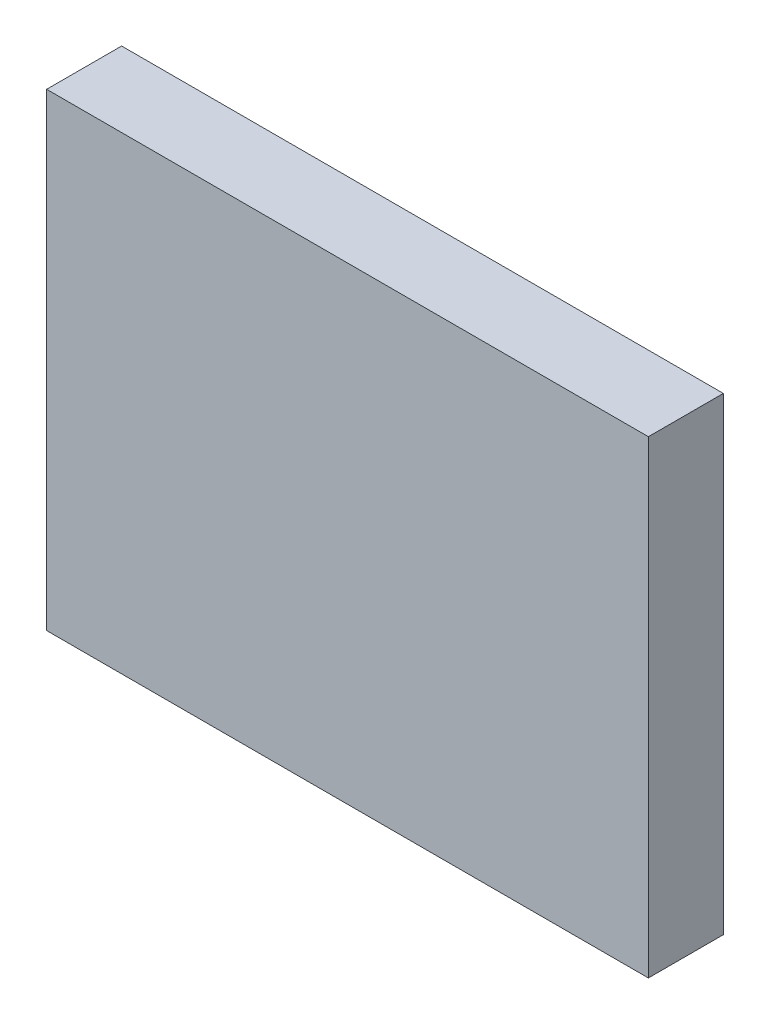
ISO-10303-21;
HEADER;
FILE_DESCRIPTION(('STEP AP214'),'2;1');
FILE_NAME('part.step','',(''),(''),'','','');
FILE_SCHEMA(('AUTOMOTIVE_DESIGN { 1 0 10303 214 1 1 1 1 }'));
ENDSEC;
DATA;
#1=APPLICATION_CONTEXT('core data for automotive mechanical design processes');
#2=APPLICATION_PROTOCOL_DEFINITION('international standard','automotive_design',2000,#1);
#3=PRODUCT_CONTEXT('',#1,'mechanical');
#4=PRODUCT('Part','Part','',(#3));
#5=PRODUCT_RELATED_PRODUCT_CATEGORY('part','',(#4));
#6=PRODUCT_DEFINITION_FORMATION('','',#4);
#7=PRODUCT_DEFINITION_CONTEXT('part definition',#1,'design');
#8=PRODUCT_DEFINITION('design','',#6,#7);
#9=PRODUCT_DEFINITION_SHAPE('','',#8);
#10=(LENGTH_UNIT() NAMED_UNIT(*) SI_UNIT(.MILLI.,.METRE.));
#11=(NAMED_UNIT(*) PLANE_ANGLE_UNIT() SI_UNIT($,.RADIAN.));
#12=(NAMED_UNIT(*) SI_UNIT($,.STERADIAN.) SOLID_ANGLE_UNIT());
#13=UNCERTAINTY_MEASURE_WITH_UNIT(LENGTH_MEASURE(1.E-05),#10,'distance_accuracy_value','');
#14=(GEOMETRIC_REPRESENTATION_CONTEXT(3) GLOBAL_UNCERTAINTY_ASSIGNED_CONTEXT((#13)) GLOBAL_UNIT_ASSIGNED_CONTEXT((#10,
#11,#12)) REPRESENTATION_CONTEXT('',''));
#15=CARTESIAN_POINT('',(0.,0.,0.));
#16=DIRECTION('',(0.,0.,1.));
#17=DIRECTION('',(1.,0.,0.));
#18=AXIS2_PLACEMENT_3D('',#15,#16,#17);
#19=CARTESIAN_POINT('',(-4.0135,-3.81,1.));
#20=DIRECTION('',(1.,0.,0.));
#21=DIRECTION('',(0.,0.,-1.));
#22=AXIS2_PLACEMENT_3D('',#19,#20,#21);
#23=PLANE('',#22);
#24=DIRECTION('',(0.,-1.,0.));
#25=VECTOR('',#24,1.);
#26=CARTESIAN_POINT('',(-4.0135,-3.81,0.));
#27=LINE('',#26,#25);
#28=CARTESIAN_POINT('',(-4.0135,2.4435,0.));
#29=VERTEX_POINT('',#28);
#30=CARTESIAN_POINT('',(-4.0135,-3.81,0.));
#31=VERTEX_POINT('',#30);
#32=EDGE_CURVE('E95',#29,#31,#27,.T.);
#33=ORIENTED_EDGE('',*,*,#32,.T.);
#34=DIRECTION('',(0.,0.,-1.));
#35=VECTOR('',#34,1.);
#36=CARTESIAN_POINT('',(-4.0135,-3.81,1.));
#37=LINE('',#36,#35);
#38=CARTESIAN_POINT('',(-4.0135,-3.81,1.));
#39=VERTEX_POINT('',#38);
#40=EDGE_CURVE('E11',#39,#31,#37,.T.);
#41=ORIENTED_EDGE('',*,*,#40,.F.);
#42=DIRECTION('',(0.,-1.,0.));
#43=VECTOR('',#42,1.);
#44=CARTESIAN_POINT('',(-4.0135,-3.81,1.));
#45=LINE('',#44,#43);
#46=CARTESIAN_POINT('',(-4.0135,2.4435,1.));
#47=VERTEX_POINT('',#46);
#48=EDGE_CURVE('E83',#47,#39,#45,.T.);
#49=ORIENTED_EDGE('',*,*,#48,.F.);
#50=DIRECTION('',(0.,0.,-1.));
#51=VECTOR('',#50,1.);
#52=CARTESIAN_POINT('',(-4.0135,2.4435,1.));
#53=LINE('',#52,#51);
#54=EDGE_CURVE('E91',#47,#29,#53,.T.);
#55=ORIENTED_EDGE('',*,*,#54,.T.);
#56=EDGE_LOOP('',(#33,#41,#49,#55));
#57=FACE_BOUND('',#56,.T.);
#58=ADVANCED_FACE('F32',(#57),#23,.F.);
#59=CARTESIAN_POINT('',(4.0135,-3.81,1.));
#60=DIRECTION('',(0.,1.,0.));
#61=DIRECTION('',(0.,0.,1.));
#62=AXIS2_PLACEMENT_3D('',#59,#60,#61);
#63=PLANE('',#62);
#64=DIRECTION('',(1.,0.,0.));
#65=VECTOR('',#64,1.);
#66=CARTESIAN_POINT('',(4.0135,-3.81,0.));
#67=LINE('',#66,#65);
#68=CARTESIAN_POINT('',(4.0135,-3.81,0.));
#69=VERTEX_POINT('',#68);
#70=EDGE_CURVE('E87',#31,#69,#67,.T.);
#71=ORIENTED_EDGE('',*,*,#70,.T.);
#72=DIRECTION('',(0.,0.,-1.));
#73=VECTOR('',#72,1.);
#74=CARTESIAN_POINT('',(4.0135,-3.81,1.));
#75=LINE('',#74,#73);
#76=CARTESIAN_POINT('',(4.0135,-3.81,1.));
#77=VERTEX_POINT('',#76);
#78=EDGE_CURVE('E40',#77,#69,#75,.T.);
#79=ORIENTED_EDGE('',*,*,#78,.F.);
#80=DIRECTION('',(1.,0.,0.));
#81=VECTOR('',#80,1.);
#82=CARTESIAN_POINT('',(4.0135,-3.81,1.));
#83=LINE('',#82,#81);
#84=EDGE_CURVE('E78',#39,#77,#83,.T.);
#85=ORIENTED_EDGE('',*,*,#84,.F.);
#86=ORIENTED_EDGE('',*,*,#40,.T.);
#87=EDGE_LOOP('',(#71,#79,#85,#86));
#88=FACE_BOUND('',#87,.T.);
#89=ADVANCED_FACE('F86',(#88),#63,.F.);
#90=CARTESIAN_POINT('',(4.0135,2.4435,1.));
#91=DIRECTION('',(-1.,0.,0.));
#92=DIRECTION('',(0.,0.,1.));
#93=AXIS2_PLACEMENT_3D('',#90,#91,#92);
#94=PLANE('',#93);
#95=DIRECTION('',(0.,1.,0.));
#96=VECTOR('',#95,1.);
#97=CARTESIAN_POINT('',(4.0135,2.4435,0.));
#98=LINE('',#97,#96);
#99=CARTESIAN_POINT('',(4.0135,2.4435,0.));
#100=VERTEX_POINT('',#99);
#101=EDGE_CURVE('E65',#69,#100,#98,.T.);
#102=ORIENTED_EDGE('',*,*,#101,.T.);
#103=DIRECTION('',(0.,0.,-1.));
#104=VECTOR('',#103,1.);
#105=CARTESIAN_POINT('',(4.0135,2.4435,1.));
#106=LINE('',#105,#104);
#107=CARTESIAN_POINT('',(4.0135,2.4435,1.));
#108=VERTEX_POINT('',#107);
#109=EDGE_CURVE('E88',#108,#100,#106,.T.);
#110=ORIENTED_EDGE('',*,*,#109,.F.);
#111=DIRECTION('',(0.,1.,0.));
#112=VECTOR('',#111,1.);
#113=CARTESIAN_POINT('',(4.0135,2.4435,1.));
#114=LINE('',#113,#112);
#115=EDGE_CURVE('E81',#77,#108,#114,.T.);
#116=ORIENTED_EDGE('',*,*,#115,.F.);
#117=ORIENTED_EDGE('',*,*,#78,.T.);
#118=EDGE_LOOP('',(#102,#110,#116,#117));
#119=FACE_BOUND('',#118,.T.);
#120=ADVANCED_FACE('F89',(#119),#94,.F.);
#121=CARTESIAN_POINT('',(-4.0135,2.4435,1.));
#122=DIRECTION('',(0.,-1.,0.));
#123=DIRECTION('',(0.,0.,-1.));
#124=AXIS2_PLACEMENT_3D('',#121,#122,#123);
#125=PLANE('',#124);
#126=DIRECTION('',(-1.,0.,0.));
#127=VECTOR('',#126,1.);
#128=CARTESIAN_POINT('',(-4.0135,2.4435,0.));
#129=LINE('',#128,#127);
#130=EDGE_CURVE('E71',#100,#29,#129,.T.);
#131=ORIENTED_EDGE('',*,*,#130,.T.);
#132=ORIENTED_EDGE('',*,*,#54,.F.);
#133=DIRECTION('',(-1.,0.,0.));
#134=VECTOR('',#133,1.);
#135=CARTESIAN_POINT('',(-4.0135,2.4435,1.));
#136=LINE('',#135,#134);
#137=EDGE_CURVE('E48',#108,#47,#136,.T.);
#138=ORIENTED_EDGE('',*,*,#137,.F.);
#139=ORIENTED_EDGE('',*,*,#109,.T.);
#140=EDGE_LOOP('',(#131,#132,#138,#139));
#141=FACE_BOUND('',#140,.T.);
#142=ADVANCED_FACE('F102',(#141),#125,.F.);
#143=CARTESIAN_POINT('',(0.,0.,1.));
#144=DIRECTION('',(0.,0.,-1.));
#145=DIRECTION('',(-1.,0.,0.));
#146=AXIS2_PLACEMENT_3D('',#143,#144,#145);
#147=PLANE('',#146);
#148=ORIENTED_EDGE('',*,*,#48,.T.);
#149=ORIENTED_EDGE('',*,*,#84,.T.);
#150=ORIENTED_EDGE('',*,*,#115,.T.);
#151=ORIENTED_EDGE('',*,*,#137,.T.);
#152=EDGE_LOOP('',(#148,#149,#150,#151));
#153=FACE_BOUND('',#152,.T.);
#154=ADVANCED_FACE('F79',(#153),#147,.F.);
#155=CARTESIAN_POINT('',(0.,0.,0.));
#156=DIRECTION('',(0.,0.,-1.));
#157=DIRECTION('',(-1.,0.,0.));
#158=AXIS2_PLACEMENT_3D('',#155,#156,#157);
#159=PLANE('',#158);
#160=ORIENTED_EDGE('',*,*,#32,.F.);
#161=ORIENTED_EDGE('',*,*,#130,.F.);
#162=ORIENTED_EDGE('',*,*,#101,.F.);
#163=ORIENTED_EDGE('',*,*,#70,.F.);
#164=EDGE_LOOP('',(#160,#161,#162,#163));
#165=FACE_BOUND('',#164,.T.);
#166=ADVANCED_FACE('F105',(#165),#159,.T.);
#167=CLOSED_SHELL('',(#58,#89,#120,#142,#154,#166));
#168=MANIFOLD_SOLID_BREP('B2',#167);
#169=ADVANCED_BREP_SHAPE_REPRESENTATION('',(#18,#168),#14);
#170=SHAPE_DEFINITION_REPRESENTATION(#9,#169);
ENDSEC;
END-ISO-10303-21;
